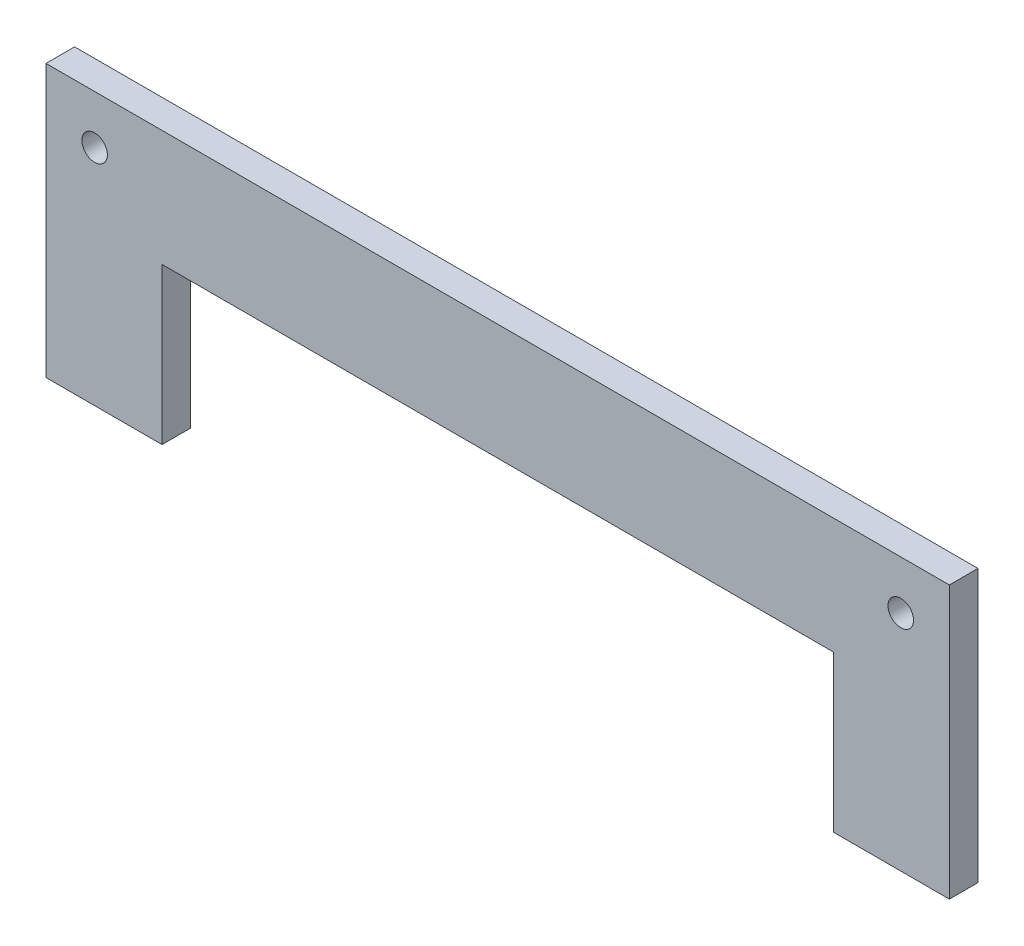
ISO-10303-21;
HEADER;
FILE_DESCRIPTION(('STEP AP214'),'2;1');
FILE_NAME('part.step','',(''),(''),'','','');
FILE_SCHEMA(('AUTOMOTIVE_DESIGN { 1 0 10303 214 1 1 1 1 }'));
ENDSEC;
DATA;
#1=APPLICATION_CONTEXT('core data for automotive mechanical design processes');
#2=APPLICATION_PROTOCOL_DEFINITION('international standard','automotive_design',2000,#1);
#3=PRODUCT_CONTEXT('',#1,'mechanical');
#4=PRODUCT('Part','Part','',(#3));
#5=PRODUCT_RELATED_PRODUCT_CATEGORY('part','',(#4));
#6=PRODUCT_DEFINITION_FORMATION('','',#4);
#7=PRODUCT_DEFINITION_CONTEXT('part definition',#1,'design');
#8=PRODUCT_DEFINITION('design','',#6,#7);
#9=PRODUCT_DEFINITION_SHAPE('','',#8);
#10=(LENGTH_UNIT() NAMED_UNIT(*) SI_UNIT(.MILLI.,.METRE.));
#11=(NAMED_UNIT(*) PLANE_ANGLE_UNIT() SI_UNIT($,.RADIAN.));
#12=(NAMED_UNIT(*) SI_UNIT($,.STERADIAN.) SOLID_ANGLE_UNIT());
#13=UNCERTAINTY_MEASURE_WITH_UNIT(LENGTH_MEASURE(1.E-05),#10,'distance_accuracy_value','');
#14=(GEOMETRIC_REPRESENTATION_CONTEXT(3) GLOBAL_UNCERTAINTY_ASSIGNED_CONTEXT((#13)) GLOBAL_UNIT_ASSIGNED_CONTEXT((#10,
#11,#12)) REPRESENTATION_CONTEXT('',''));
#15=CARTESIAN_POINT('',(0.,0.,0.));
#16=DIRECTION('',(0.,0.,1.));
#17=DIRECTION('',(1.,0.,0.));
#18=AXIS2_PLACEMENT_3D('',#15,#16,#17);
#19=CARTESIAN_POINT('',(0.,0.,3.175));
#20=DIRECTION('',(0.,0.,1.));
#21=DIRECTION('',(1.,0.,0.));
#22=AXIS2_PLACEMENT_3D('',#19,#20,#21);
#23=PLANE('',#22);
#24=CARTESIAN_POINT('',(-44.6966991411009,-5.30330085889911,3.175));
#25=DIRECTION('',(0.,0.,1.));
#26=DIRECTION('',(1.,0.,0.));
#27=AXIS2_PLACEMENT_3D('',#24,#25,#26);
#28=CIRCLE('',#27,1.415);
#29=CARTESIAN_POINT('',(-43.2816991411009,-5.30330085889911,3.175));
#30=VERTEX_POINT('',#29);
#31=EDGE_CURVE('E137',#30,#30,#28,.T.);
#32=ORIENTED_EDGE('',*,*,#31,.F.);
#33=EDGE_LOOP('',(#32));
#34=FACE_BOUND('',#33,.T.);
#35=DIRECTION('',(1.,0.,0.));
#36=VECTOR('',#35,1.);
#37=CARTESIAN_POINT('',(37.215,-30.085,3.175));
#38=LINE('',#37,#36);
#39=CARTESIAN_POINT('',(37.215,-30.085,3.175));
#40=VERTEX_POINT('',#39);
#41=CARTESIAN_POINT('',(50.085,-30.085,3.175));
#42=VERTEX_POINT('',#41);
#43=EDGE_CURVE('E148',#40,#42,#38,.T.);
#44=ORIENTED_EDGE('',*,*,#43,.T.);
#45=DIRECTION('',(0.,1.,0.));
#46=VECTOR('',#45,1.);
#47=CARTESIAN_POINT('',(50.085,-30.085,3.175));
#48=LINE('',#47,#46);
#49=CARTESIAN_POINT('',(50.085,0.085,3.175));
#50=VERTEX_POINT('',#49);
#51=EDGE_CURVE('E96',#42,#50,#48,.T.);
#52=ORIENTED_EDGE('',*,*,#51,.T.);
#53=DIRECTION('',(-1.,0.,0.));
#54=VECTOR('',#53,1.);
#55=CARTESIAN_POINT('',(-50.085,0.085,3.175));
#56=LINE('',#55,#54);
#57=CARTESIAN_POINT('',(-50.085,0.085,3.175));
#58=VERTEX_POINT('',#57);
#59=EDGE_CURVE('E163',#50,#58,#56,.T.);
#60=ORIENTED_EDGE('',*,*,#59,.T.);
#61=DIRECTION('',(0.,-1.,0.));
#62=VECTOR('',#61,1.);
#63=CARTESIAN_POINT('',(-50.085,0.085,3.175));
#64=LINE('',#63,#62);
#65=CARTESIAN_POINT('',(-50.085,-30.085,3.175));
#66=VERTEX_POINT('',#65);
#67=EDGE_CURVE('E176',#58,#66,#64,.T.);
#68=ORIENTED_EDGE('',*,*,#67,.T.);
#69=DIRECTION('',(1.,0.,0.));
#70=VECTOR('',#69,1.);
#71=CARTESIAN_POINT('',(-50.085,-30.085,3.175));
#72=LINE('',#71,#70);
#73=CARTESIAN_POINT('',(-37.215,-30.085,3.175));
#74=VERTEX_POINT('',#73);
#75=EDGE_CURVE('E115',#66,#74,#72,.T.);
#76=ORIENTED_EDGE('',*,*,#75,.T.);
#77=DIRECTION('',(0.,1.,0.));
#78=VECTOR('',#77,1.);
#79=CARTESIAN_POINT('',(-37.215,-30.085,3.175));
#80=LINE('',#79,#78);
#81=CARTESIAN_POINT('',(-37.215,-12.785,3.175));
#82=VERTEX_POINT('',#81);
#83=EDGE_CURVE('E109',#74,#82,#80,.T.);
#84=ORIENTED_EDGE('',*,*,#83,.T.);
#85=DIRECTION('',(1.,0.,0.));
#86=VECTOR('',#85,1.);
#87=CARTESIAN_POINT('',(-37.215,-12.785,3.175));
#88=LINE('',#87,#86);
#89=CARTESIAN_POINT('',(37.215,-12.785,3.175));
#90=VERTEX_POINT('',#89);
#91=EDGE_CURVE('E113',#82,#90,#88,.T.);
#92=ORIENTED_EDGE('',*,*,#91,.T.);
#93=DIRECTION('',(0.,-1.,0.));
#94=VECTOR('',#93,1.);
#95=CARTESIAN_POINT('',(37.215,-12.785,3.175));
#96=LINE('',#95,#94);
#97=EDGE_CURVE('E53',#90,#40,#96,.T.);
#98=ORIENTED_EDGE('',*,*,#97,.T.);
#99=EDGE_LOOP('',(#44,#52,#60,#68,#76,#84,#92,#98));
#100=FACE_BOUND('',#99,.T.);
#101=CARTESIAN_POINT('',(44.6966991411009,-5.30330085889911,3.175));
#102=DIRECTION('',(0.,0.,1.));
#103=DIRECTION('',(-1.,0.,0.));
#104=AXIS2_PLACEMENT_3D('',#101,#102,#103);
#105=CIRCLE('',#104,1.415);
#106=CARTESIAN_POINT('',(43.2816991411009,-5.30330085889911,3.175));
#107=VERTEX_POINT('',#106);
#108=EDGE_CURVE('E185',#107,#107,#105,.T.);
#109=ORIENTED_EDGE('',*,*,#108,.F.);
#110=EDGE_LOOP('',(#109));
#111=FACE_BOUND('',#110,.T.);
#112=ADVANCED_FACE('F36',(#34,#100,#111),#23,.T.);
#113=CARTESIAN_POINT('',(0.,0.,0.));
#114=DIRECTION('',(0.,0.,1.));
#115=DIRECTION('',(1.,0.,0.));
#116=AXIS2_PLACEMENT_3D('',#113,#114,#115);
#117=PLANE('',#116);
#118=DIRECTION('',(1.,0.,0.));
#119=VECTOR('',#118,1.);
#120=CARTESIAN_POINT('',(37.215,-30.085,0.));
#121=LINE('',#120,#119);
#122=CARTESIAN_POINT('',(37.215,-30.085,0.));
#123=VERTEX_POINT('',#122);
#124=CARTESIAN_POINT('',(50.085,-30.085,0.));
#125=VERTEX_POINT('',#124);
#126=EDGE_CURVE('E133',#123,#125,#121,.T.);
#127=ORIENTED_EDGE('',*,*,#126,.F.);
#128=DIRECTION('',(0.,-1.,0.));
#129=VECTOR('',#128,1.);
#130=CARTESIAN_POINT('',(37.215,-12.785,0.));
#131=LINE('',#130,#129);
#132=CARTESIAN_POINT('',(37.215,-12.785,0.));
#133=VERTEX_POINT('',#132);
#134=EDGE_CURVE('E88',#133,#123,#131,.T.);
#135=ORIENTED_EDGE('',*,*,#134,.F.);
#136=DIRECTION('',(1.,0.,0.));
#137=VECTOR('',#136,1.);
#138=CARTESIAN_POINT('',(-37.215,-12.785,0.));
#139=LINE('',#138,#137);
#140=CARTESIAN_POINT('',(-37.215,-12.785,0.));
#141=VERTEX_POINT('',#140);
#142=EDGE_CURVE('E82',#141,#133,#139,.T.);
#143=ORIENTED_EDGE('',*,*,#142,.F.);
#144=DIRECTION('',(0.,1.,0.));
#145=VECTOR('',#144,1.);
#146=CARTESIAN_POINT('',(-37.215,-30.085,0.));
#147=LINE('',#146,#145);
#148=CARTESIAN_POINT('',(-37.215,-30.085,0.));
#149=VERTEX_POINT('',#148);
#150=EDGE_CURVE('E123',#149,#141,#147,.T.);
#151=ORIENTED_EDGE('',*,*,#150,.F.);
#152=DIRECTION('',(1.,0.,0.));
#153=VECTOR('',#152,1.);
#154=CARTESIAN_POINT('',(-50.085,-30.085,0.));
#155=LINE('',#154,#153);
#156=CARTESIAN_POINT('',(-50.085,-30.085,0.));
#157=VERTEX_POINT('',#156);
#158=EDGE_CURVE('E143',#157,#149,#155,.T.);
#159=ORIENTED_EDGE('',*,*,#158,.F.);
#160=DIRECTION('',(0.,-1.,0.));
#161=VECTOR('',#160,1.);
#162=CARTESIAN_POINT('',(-50.085,0.085,0.));
#163=LINE('',#162,#161);
#164=CARTESIAN_POINT('',(-50.085,0.085,0.));
#165=VERTEX_POINT('',#164);
#166=EDGE_CURVE('E141',#165,#157,#163,.T.);
#167=ORIENTED_EDGE('',*,*,#166,.F.);
#168=DIRECTION('',(-1.,0.,0.));
#169=VECTOR('',#168,1.);
#170=CARTESIAN_POINT('',(-50.085,0.085,0.));
#171=LINE('',#170,#169);
#172=CARTESIAN_POINT('',(50.085,0.085,0.));
#173=VERTEX_POINT('',#172);
#174=EDGE_CURVE('E139',#173,#165,#171,.T.);
#175=ORIENTED_EDGE('',*,*,#174,.F.);
#176=DIRECTION('',(0.,1.,0.));
#177=VECTOR('',#176,1.);
#178=CARTESIAN_POINT('',(50.085,-30.085,0.));
#179=LINE('',#178,#177);
#180=EDGE_CURVE('E136',#125,#173,#179,.T.);
#181=ORIENTED_EDGE('',*,*,#180,.F.);
#182=EDGE_LOOP('',(#127,#135,#143,#151,#159,#167,#175,#181));
#183=FACE_BOUND('',#182,.T.);
#184=CARTESIAN_POINT('',(-44.6966991411009,-5.30330085889911,0.));
#185=DIRECTION('',(0.,0.,1.));
#186=DIRECTION('',(1.,0.,0.));
#187=AXIS2_PLACEMENT_3D('',#184,#185,#186);
#188=CIRCLE('',#187,1.415);
#189=CARTESIAN_POINT('',(-43.2816991411009,-5.30330085889911,0.));
#190=VERTEX_POINT('',#189);
#191=EDGE_CURVE('E182',#190,#190,#188,.T.);
#192=ORIENTED_EDGE('',*,*,#191,.T.);
#193=EDGE_LOOP('',(#192));
#194=FACE_BOUND('',#193,.T.);
#195=CARTESIAN_POINT('',(44.6966991411009,-5.30330085889911,0.));
#196=DIRECTION('',(0.,0.,1.));
#197=DIRECTION('',(-1.,0.,0.));
#198=AXIS2_PLACEMENT_3D('',#195,#196,#197);
#199=CIRCLE('',#198,1.415);
#200=CARTESIAN_POINT('',(43.2816991411009,-5.30330085889911,0.));
#201=VERTEX_POINT('',#200);
#202=EDGE_CURVE('E188',#201,#201,#199,.T.);
#203=ORIENTED_EDGE('',*,*,#202,.T.);
#204=EDGE_LOOP('',(#203));
#205=FACE_BOUND('',#204,.T.);
#206=ADVANCED_FACE('F167',(#183,#194,#205),#117,.F.);
#207=CARTESIAN_POINT('',(37.215,-30.085,3.175));
#208=DIRECTION('',(0.,1.,0.));
#209=DIRECTION('',(0.,0.,1.));
#210=AXIS2_PLACEMENT_3D('',#207,#208,#209);
#211=PLANE('',#210);
#212=ORIENTED_EDGE('',*,*,#126,.T.);
#213=DIRECTION('',(0.,0.,-1.));
#214=VECTOR('',#213,1.);
#215=CARTESIAN_POINT('',(50.085,-30.085,3.175));
#216=LINE('',#215,#214);
#217=EDGE_CURVE('E11',#42,#125,#216,.T.);
#218=ORIENTED_EDGE('',*,*,#217,.F.);
#219=ORIENTED_EDGE('',*,*,#43,.F.);
#220=DIRECTION('',(0.,0.,-1.));
#221=VECTOR('',#220,1.);
#222=CARTESIAN_POINT('',(37.215,-30.085,3.175));
#223=LINE('',#222,#221);
#224=EDGE_CURVE('E129',#40,#123,#223,.T.);
#225=ORIENTED_EDGE('',*,*,#224,.T.);
#226=EDGE_LOOP('',(#212,#218,#219,#225));
#227=FACE_BOUND('',#226,.T.);
#228=ADVANCED_FACE('F38',(#227),#211,.F.);
#229=CARTESIAN_POINT('',(50.085,-30.085,3.175));
#230=DIRECTION('',(-1.,0.,0.));
#231=DIRECTION('',(0.,0.,1.));
#232=AXIS2_PLACEMENT_3D('',#229,#230,#231);
#233=PLANE('',#232);
#234=ORIENTED_EDGE('',*,*,#180,.T.);
#235=DIRECTION('',(0.,0.,-1.));
#236=VECTOR('',#235,1.);
#237=CARTESIAN_POINT('',(50.085,0.085,3.175));
#238=LINE('',#237,#236);
#239=EDGE_CURVE('E45',#50,#173,#238,.T.);
#240=ORIENTED_EDGE('',*,*,#239,.F.);
#241=ORIENTED_EDGE('',*,*,#51,.F.);
#242=ORIENTED_EDGE('',*,*,#217,.T.);
#243=EDGE_LOOP('',(#234,#240,#241,#242));
#244=FACE_BOUND('',#243,.T.);
#245=ADVANCED_FACE('F220',(#244),#233,.F.);
#246=CARTESIAN_POINT('',(-50.085,0.085,3.175));
#247=DIRECTION('',(0.,-1.,0.));
#248=DIRECTION('',(0.,0.,-1.));
#249=AXIS2_PLACEMENT_3D('',#246,#247,#248);
#250=PLANE('',#249);
#251=ORIENTED_EDGE('',*,*,#174,.T.);
#252=DIRECTION('',(0.,0.,-1.));
#253=VECTOR('',#252,1.);
#254=CARTESIAN_POINT('',(-50.085,0.085,3.175));
#255=LINE('',#254,#253);
#256=EDGE_CURVE('E155',#58,#165,#255,.T.);
#257=ORIENTED_EDGE('',*,*,#256,.F.);
#258=ORIENTED_EDGE('',*,*,#59,.F.);
#259=ORIENTED_EDGE('',*,*,#239,.T.);
#260=EDGE_LOOP('',(#251,#257,#258,#259));
#261=FACE_BOUND('',#260,.T.);
#262=ADVANCED_FACE('F161',(#261),#250,.F.);
#263=CARTESIAN_POINT('',(-50.085,0.085,3.175));
#264=DIRECTION('',(1.,0.,0.));
#265=DIRECTION('',(0.,1.,0.));
#266=AXIS2_PLACEMENT_3D('',#263,#264,#265);
#267=PLANE('',#266);
#268=ORIENTED_EDGE('',*,*,#166,.T.);
#269=DIRECTION('',(0.,0.,-1.));
#270=VECTOR('',#269,1.);
#271=CARTESIAN_POINT('',(-50.085,-30.085,3.175));
#272=LINE('',#271,#270);
#273=EDGE_CURVE('E152',#66,#157,#272,.T.);
#274=ORIENTED_EDGE('',*,*,#273,.F.);
#275=ORIENTED_EDGE('',*,*,#67,.F.);
#276=ORIENTED_EDGE('',*,*,#256,.T.);
#277=EDGE_LOOP('',(#268,#274,#275,#276));
#278=FACE_BOUND('',#277,.T.);
#279=ADVANCED_FACE('F172',(#278),#267,.F.);
#280=CARTESIAN_POINT('',(-50.085,-30.085,3.175));
#281=DIRECTION('',(0.,1.,0.));
#282=DIRECTION('',(0.,0.,1.));
#283=AXIS2_PLACEMENT_3D('',#280,#281,#282);
#284=PLANE('',#283);
#285=ORIENTED_EDGE('',*,*,#158,.T.);
#286=DIRECTION('',(0.,0.,-1.));
#287=VECTOR('',#286,1.);
#288=CARTESIAN_POINT('',(-37.215,-30.085,3.175));
#289=LINE('',#288,#287);
#290=EDGE_CURVE('E124',#74,#149,#289,.T.);
#291=ORIENTED_EDGE('',*,*,#290,.F.);
#292=ORIENTED_EDGE('',*,*,#75,.F.);
#293=ORIENTED_EDGE('',*,*,#273,.T.);
#294=EDGE_LOOP('',(#285,#291,#292,#293));
#295=FACE_BOUND('',#294,.T.);
#296=ADVANCED_FACE('F175',(#295),#284,.F.);
#297=CARTESIAN_POINT('',(-37.215,-30.085,3.175));
#298=DIRECTION('',(-1.,0.,0.));
#299=DIRECTION('',(0.,0.,1.));
#300=AXIS2_PLACEMENT_3D('',#297,#298,#299);
#301=PLANE('',#300);
#302=ORIENTED_EDGE('',*,*,#150,.T.);
#303=DIRECTION('',(0.,0.,-1.));
#304=VECTOR('',#303,1.);
#305=CARTESIAN_POINT('',(-37.215,-12.785,3.175));
#306=LINE('',#305,#304);
#307=EDGE_CURVE('E120',#82,#141,#306,.T.);
#308=ORIENTED_EDGE('',*,*,#307,.F.);
#309=ORIENTED_EDGE('',*,*,#83,.F.);
#310=ORIENTED_EDGE('',*,*,#290,.T.);
#311=EDGE_LOOP('',(#302,#308,#309,#310));
#312=FACE_BOUND('',#311,.T.);
#313=ADVANCED_FACE('F121',(#312),#301,.F.);
#314=CARTESIAN_POINT('',(-37.215,-12.785,3.175));
#315=DIRECTION('',(0.,1.,0.));
#316=DIRECTION('',(0.,0.,1.));
#317=AXIS2_PLACEMENT_3D('',#314,#315,#316);
#318=PLANE('',#317);
#319=ORIENTED_EDGE('',*,*,#142,.T.);
#320=DIRECTION('',(0.,0.,-1.));
#321=VECTOR('',#320,1.);
#322=CARTESIAN_POINT('',(37.215,-12.785,3.175));
#323=LINE('',#322,#321);
#324=EDGE_CURVE('E125',#90,#133,#323,.T.);
#325=ORIENTED_EDGE('',*,*,#324,.F.);
#326=ORIENTED_EDGE('',*,*,#91,.F.);
#327=ORIENTED_EDGE('',*,*,#307,.T.);
#328=EDGE_LOOP('',(#319,#325,#326,#327));
#329=FACE_BOUND('',#328,.T.);
#330=ADVANCED_FACE('F127',(#329),#318,.F.);
#331=CARTESIAN_POINT('',(37.215,-12.785,3.175));
#332=DIRECTION('',(1.,0.,0.));
#333=DIRECTION('',(0.,0.,-1.));
#334=AXIS2_PLACEMENT_3D('',#331,#332,#333);
#335=PLANE('',#334);
#336=ORIENTED_EDGE('',*,*,#134,.T.);
#337=ORIENTED_EDGE('',*,*,#224,.F.);
#338=ORIENTED_EDGE('',*,*,#97,.F.);
#339=ORIENTED_EDGE('',*,*,#324,.T.);
#340=EDGE_LOOP('',(#336,#337,#338,#339));
#341=FACE_BOUND('',#340,.T.);
#342=ADVANCED_FACE('F208',(#341),#335,.F.);
#343=CARTESIAN_POINT('',(-44.6966991411009,-5.30330085889911,3.175));
#344=DIRECTION('',(0.,0.,-1.));
#345=DIRECTION('',(-1.,0.,0.));
#346=AXIS2_PLACEMENT_3D('',#343,#344,#345);
#347=CYLINDRICAL_SURFACE('',#346,1.415);
#348=ORIENTED_EDGE('',*,*,#31,.T.);
#349=EDGE_LOOP('',(#348));
#350=FACE_BOUND('',#349,.T.);
#351=ORIENTED_EDGE('',*,*,#191,.F.);
#352=EDGE_LOOP('',(#351));
#353=FACE_BOUND('',#352,.T.);
#354=ADVANCED_FACE('F205',(#350,#353),#347,.F.);
#355=CARTESIAN_POINT('',(44.6966991411009,-5.30330085889911,3.175));
#356=DIRECTION('',(0.,0.,-1.));
#357=DIRECTION('',(-1.,0.,0.));
#358=AXIS2_PLACEMENT_3D('',#355,#356,#357);
#359=CYLINDRICAL_SURFACE('',#358,1.415);
#360=ORIENTED_EDGE('',*,*,#108,.T.);
#361=EDGE_LOOP('',(#360));
#362=FACE_BOUND('',#361,.T.);
#363=ORIENTED_EDGE('',*,*,#202,.F.);
#364=EDGE_LOOP('',(#363));
#365=FACE_BOUND('',#364,.T.);
#366=ADVANCED_FACE('F194',(#362,#365),#359,.F.);
#367=CLOSED_SHELL('',(#112,#206,#228,#245,#262,#279,#296,#313,#330,#342,#354,#366));
#368=MANIFOLD_SOLID_BREP('B2',#367);
#369=ADVANCED_BREP_SHAPE_REPRESENTATION('',(#18,#368),#14);
#370=SHAPE_DEFINITION_REPRESENTATION(#9,#369);
ENDSEC;
END-ISO-10303-21;
